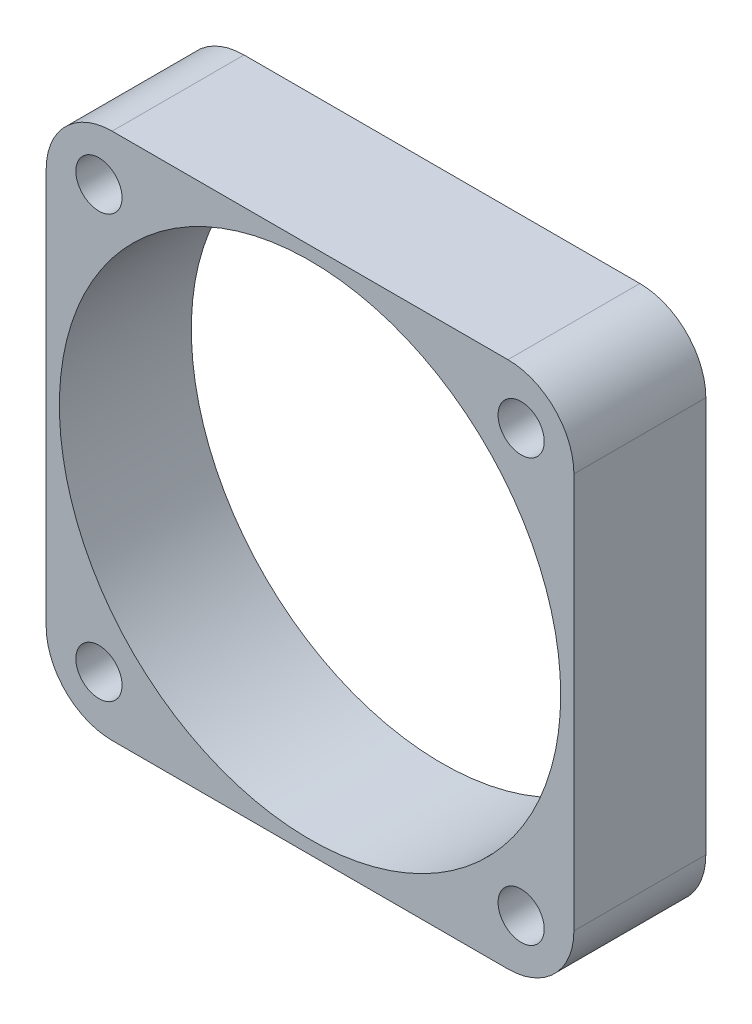
ISO-10303-21;
HEADER;
FILE_DESCRIPTION(('STEP AP214'),'2;1');
FILE_NAME('part.step','',(''),(''),'','','');
FILE_SCHEMA(('AUTOMOTIVE_DESIGN { 1 0 10303 214 1 1 1 1 }'));
ENDSEC;
DATA;
#1=APPLICATION_CONTEXT('core data for automotive mechanical design processes');
#2=APPLICATION_PROTOCOL_DEFINITION('international standard','automotive_design',2000,#1);
#3=PRODUCT_CONTEXT('',#1,'mechanical');
#4=PRODUCT('Part','Part','',(#3));
#5=PRODUCT_RELATED_PRODUCT_CATEGORY('part','',(#4));
#6=PRODUCT_DEFINITION_FORMATION('','',#4);
#7=PRODUCT_DEFINITION_CONTEXT('part definition',#1,'design');
#8=PRODUCT_DEFINITION('design','',#6,#7);
#9=PRODUCT_DEFINITION_SHAPE('','',#8);
#10=(LENGTH_UNIT() NAMED_UNIT(*) SI_UNIT(.MILLI.,.METRE.));
#11=(NAMED_UNIT(*) PLANE_ANGLE_UNIT() SI_UNIT($,.RADIAN.));
#12=(NAMED_UNIT(*) SI_UNIT($,.STERADIAN.) SOLID_ANGLE_UNIT());
#13=UNCERTAINTY_MEASURE_WITH_UNIT(LENGTH_MEASURE(1.E-05),#10,'distance_accuracy_value','');
#14=(GEOMETRIC_REPRESENTATION_CONTEXT(3) GLOBAL_UNCERTAINTY_ASSIGNED_CONTEXT((#13)) GLOBAL_UNIT_ASSIGNED_CONTEXT((#10,
#11,#12)) REPRESENTATION_CONTEXT('',''));
#15=CARTESIAN_POINT('',(0.,0.,0.));
#16=DIRECTION('',(0.,0.,1.));
#17=DIRECTION('',(1.,0.,0.));
#18=AXIS2_PLACEMENT_3D('',#15,#16,#17);
#19=CARTESIAN_POINT('',(0.,0.,10.));
#20=DIRECTION('',(1.,0.,0.));
#21=DIRECTION('',(0.,0.,-1.));
#22=AXIS2_PLACEMENT_3D('',#19,#20,#21);
#23=PLANE('',#22);
#24=DIRECTION('',(0.,-1.,0.));
#25=VECTOR('',#24,1.);
#26=CARTESIAN_POINT('',(0.,0.,0.));
#27=LINE('',#26,#25);
#28=CARTESIAN_POINT('',(0.,35.,0.));
#29=VERTEX_POINT('',#28);
#30=CARTESIAN_POINT('',(0.,5.,0.));
#31=VERTEX_POINT('',#30);
#32=EDGE_CURVE('E151',#29,#31,#27,.T.);
#33=ORIENTED_EDGE('',*,*,#32,.T.);
#34=DIRECTION('',(0.,0.,-1.));
#35=VECTOR('',#34,1.);
#36=CARTESIAN_POINT('',(0.,5.,10.));
#37=LINE('',#36,#35);
#38=CARTESIAN_POINT('',(0.,5.,10.));
#39=VERTEX_POINT('',#38);
#40=EDGE_CURVE('E129',#31,#39,#37,.F.);
#41=ORIENTED_EDGE('',*,*,#40,.T.);
#42=DIRECTION('',(0.,-1.,0.));
#43=VECTOR('',#42,1.);
#44=CARTESIAN_POINT('',(0.,0.,10.));
#45=LINE('',#44,#43);
#46=CARTESIAN_POINT('',(0.,35.,10.));
#47=VERTEX_POINT('',#46);
#48=EDGE_CURVE('E161',#47,#39,#45,.T.);
#49=ORIENTED_EDGE('',*,*,#48,.F.);
#50=DIRECTION('',(0.,0.,-1.));
#51=VECTOR('',#50,1.);
#52=CARTESIAN_POINT('',(0.,35.,10.));
#53=LINE('',#52,#51);
#54=EDGE_CURVE('E134',#47,#29,#53,.T.);
#55=ORIENTED_EDGE('',*,*,#54,.T.);
#56=EDGE_LOOP('',(#33,#41,#49,#55));
#57=FACE_BOUND('',#56,.T.);
#58=ADVANCED_FACE('F59',(#57),#23,.F.);
#59=CARTESIAN_POINT('',(0.,0.,10.));
#60=DIRECTION('',(0.,1.,0.));
#61=DIRECTION('',(0.,0.,1.));
#62=AXIS2_PLACEMENT_3D('',#59,#60,#61);
#63=PLANE('',#62);
#64=DIRECTION('',(1.,0.,0.));
#65=VECTOR('',#64,1.);
#66=CARTESIAN_POINT('',(0.,0.,10.));
#67=LINE('',#66,#65);
#68=CARTESIAN_POINT('',(5.,0.,10.));
#69=VERTEX_POINT('',#68);
#70=CARTESIAN_POINT('',(35.,0.,10.));
#71=VERTEX_POINT('',#70);
#72=EDGE_CURVE('E144',#69,#71,#67,.T.);
#73=ORIENTED_EDGE('',*,*,#72,.F.);
#74=DIRECTION('',(0.,0.,-1.));
#75=VECTOR('',#74,1.);
#76=CARTESIAN_POINT('',(5.,0.,10.));
#77=LINE('',#76,#75);
#78=CARTESIAN_POINT('',(5.,0.,0.));
#79=VERTEX_POINT('',#78);
#80=EDGE_CURVE('E128',#69,#79,#77,.T.);
#81=ORIENTED_EDGE('',*,*,#80,.T.);
#82=DIRECTION('',(1.,0.,0.));
#83=VECTOR('',#82,1.);
#84=CARTESIAN_POINT('',(0.,0.,0.));
#85=LINE('',#84,#83);
#86=CARTESIAN_POINT('',(35.,0.,0.));
#87=VERTEX_POINT('',#86);
#88=EDGE_CURVE('E141',#79,#87,#85,.T.);
#89=ORIENTED_EDGE('',*,*,#88,.T.);
#90=DIRECTION('',(0.,0.,-1.));
#91=VECTOR('',#90,1.);
#92=CARTESIAN_POINT('',(35.,0.,10.));
#93=LINE('',#92,#91);
#94=EDGE_CURVE('E146',#87,#71,#93,.F.);
#95=ORIENTED_EDGE('',*,*,#94,.T.);
#96=EDGE_LOOP('',(#73,#81,#89,#95));
#97=FACE_BOUND('',#96,.T.);
#98=ADVANCED_FACE('F140',(#97),#63,.F.);
#99=CARTESIAN_POINT('',(40.,0.,10.));
#100=DIRECTION('',(-1.,0.,0.));
#101=DIRECTION('',(0.,0.,1.));
#102=AXIS2_PLACEMENT_3D('',#99,#100,#101);
#103=PLANE('',#102);
#104=DIRECTION('',(0.,1.,0.));
#105=VECTOR('',#104,1.);
#106=CARTESIAN_POINT('',(40.,0.,10.));
#107=LINE('',#106,#105);
#108=CARTESIAN_POINT('',(40.,5.,10.));
#109=VERTEX_POINT('',#108);
#110=CARTESIAN_POINT('',(40.,35.,10.));
#111=VERTEX_POINT('',#110);
#112=EDGE_CURVE('E195',#109,#111,#107,.T.);
#113=ORIENTED_EDGE('',*,*,#112,.F.);
#114=DIRECTION('',(0.,0.,-1.));
#115=VECTOR('',#114,1.);
#116=CARTESIAN_POINT('',(40.,5.,10.));
#117=LINE('',#116,#115);
#118=CARTESIAN_POINT('',(40.,5.,0.));
#119=VERTEX_POINT('',#118);
#120=EDGE_CURVE('E180',#109,#119,#117,.T.);
#121=ORIENTED_EDGE('',*,*,#120,.T.);
#122=DIRECTION('',(0.,1.,0.));
#123=VECTOR('',#122,1.);
#124=CARTESIAN_POINT('',(40.,0.,0.));
#125=LINE('',#124,#123);
#126=CARTESIAN_POINT('',(40.,35.,0.));
#127=VERTEX_POINT('',#126);
#128=EDGE_CURVE('E150',#119,#127,#125,.T.);
#129=ORIENTED_EDGE('',*,*,#128,.T.);
#130=DIRECTION('',(0.,0.,-1.));
#131=VECTOR('',#130,1.);
#132=CARTESIAN_POINT('',(40.,35.,10.));
#133=LINE('',#132,#131);
#134=EDGE_CURVE('E178',#127,#111,#133,.F.);
#135=ORIENTED_EDGE('',*,*,#134,.T.);
#136=EDGE_LOOP('',(#113,#121,#129,#135));
#137=FACE_BOUND('',#136,.T.);
#138=ADVANCED_FACE('F212',(#137),#103,.F.);
#139=CARTESIAN_POINT('',(0.,40.,10.));
#140=DIRECTION('',(0.,-1.,0.));
#141=DIRECTION('',(0.,0.,-1.));
#142=AXIS2_PLACEMENT_3D('',#139,#140,#141);
#143=PLANE('',#142);
#144=DIRECTION('',(-1.,0.,0.));
#145=VECTOR('',#144,1.);
#146=CARTESIAN_POINT('',(0.,40.,0.));
#147=LINE('',#146,#145);
#148=CARTESIAN_POINT('',(35.,40.,0.));
#149=VERTEX_POINT('',#148);
#150=CARTESIAN_POINT('',(5.,40.,0.));
#151=VERTEX_POINT('',#150);
#152=EDGE_CURVE('E154',#149,#151,#147,.T.);
#153=ORIENTED_EDGE('',*,*,#152,.T.);
#154=DIRECTION('',(0.,0.,-1.));
#155=VECTOR('',#154,1.);
#156=CARTESIAN_POINT('',(5.,40.,10.));
#157=LINE('',#156,#155);
#158=CARTESIAN_POINT('',(5.,40.,10.));
#159=VERTEX_POINT('',#158);
#160=EDGE_CURVE('E12',#151,#159,#157,.F.);
#161=ORIENTED_EDGE('',*,*,#160,.T.);
#162=DIRECTION('',(-1.,0.,0.));
#163=VECTOR('',#162,1.);
#164=CARTESIAN_POINT('',(0.,40.,10.));
#165=LINE('',#164,#163);
#166=CARTESIAN_POINT('',(35.,40.,10.));
#167=VERTEX_POINT('',#166);
#168=EDGE_CURVE('E162',#167,#159,#165,.T.);
#169=ORIENTED_EDGE('',*,*,#168,.F.);
#170=DIRECTION('',(0.,0.,-1.));
#171=VECTOR('',#170,1.);
#172=CARTESIAN_POINT('',(35.,40.,10.));
#173=LINE('',#172,#171);
#174=EDGE_CURVE('E67',#167,#149,#173,.T.);
#175=ORIENTED_EDGE('',*,*,#174,.T.);
#176=EDGE_LOOP('',(#153,#161,#169,#175));
#177=FACE_BOUND('',#176,.T.);
#178=ADVANCED_FACE('F185',(#177),#143,.F.);
#179=CARTESIAN_POINT('',(0.,0.,10.));
#180=DIRECTION('',(0.,0.,-1.));
#181=DIRECTION('',(-1.,0.,0.));
#182=AXIS2_PLACEMENT_3D('',#179,#180,#181);
#183=PLANE('',#182);
#184=CARTESIAN_POINT('',(36.,36.,10.));
#185=DIRECTION('',(0.,0.,1.));
#186=DIRECTION('',(1.,0.,0.));
#187=AXIS2_PLACEMENT_3D('',#184,#185,#186);
#188=CIRCLE('',#187,1.75);
#189=CARTESIAN_POINT('',(37.75,36.,10.));
#190=VERTEX_POINT('',#189);
#191=EDGE_CURVE('E361',#190,#190,#188,.T.);
#192=ORIENTED_EDGE('',*,*,#191,.F.);
#193=EDGE_LOOP('',(#192));
#194=FACE_BOUND('',#193,.T.);
#195=CARTESIAN_POINT('',(36.,4.00000000000001,10.));
#196=DIRECTION('',(0.,0.,1.));
#197=DIRECTION('',(1.,0.,0.));
#198=AXIS2_PLACEMENT_3D('',#195,#196,#197);
#199=CIRCLE('',#198,1.75);
#200=CARTESIAN_POINT('',(37.75,4.00000000000001,10.));
#201=VERTEX_POINT('',#200);
#202=EDGE_CURVE('E355',#201,#201,#199,.T.);
#203=ORIENTED_EDGE('',*,*,#202,.F.);
#204=EDGE_LOOP('',(#203));
#205=FACE_BOUND('',#204,.T.);
#206=CARTESIAN_POINT('',(4.,4.00000000000001,10.));
#207=DIRECTION('',(0.,0.,1.));
#208=DIRECTION('',(1.,0.,0.));
#209=AXIS2_PLACEMENT_3D('',#206,#207,#208);
#210=CIRCLE('',#209,1.75);
#211=CARTESIAN_POINT('',(5.75,4.00000000000001,10.));
#212=VERTEX_POINT('',#211);
#213=EDGE_CURVE('E349',#212,#212,#210,.T.);
#214=ORIENTED_EDGE('',*,*,#213,.F.);
#215=EDGE_LOOP('',(#214));
#216=FACE_BOUND('',#215,.T.);
#217=CARTESIAN_POINT('',(4.,36.,10.));
#218=DIRECTION('',(0.,0.,1.));
#219=DIRECTION('',(1.,0.,0.));
#220=AXIS2_PLACEMENT_3D('',#217,#218,#219);
#221=CIRCLE('',#220,1.75);
#222=CARTESIAN_POINT('',(5.75,36.,10.));
#223=VERTEX_POINT('',#222);
#224=EDGE_CURVE('E341',#223,#223,#221,.T.);
#225=ORIENTED_EDGE('',*,*,#224,.F.);
#226=EDGE_LOOP('',(#225));
#227=FACE_BOUND('',#226,.T.);
#228=CARTESIAN_POINT('',(20.,20.,10.));
#229=DIRECTION('',(0.,0.,1.));
#230=DIRECTION('',(1.,0.,0.));
#231=AXIS2_PLACEMENT_3D('',#228,#229,#230);
#232=CIRCLE('',#231,19.);
#233=CARTESIAN_POINT('',(39.,20.,10.));
#234=VERTEX_POINT('',#233);
#235=EDGE_CURVE('E198',#234,#234,#232,.T.);
#236=ORIENTED_EDGE('',*,*,#235,.F.);
#237=EDGE_LOOP('',(#236));
#238=FACE_BOUND('',#237,.T.);
#239=ORIENTED_EDGE('',*,*,#48,.T.);
#240=CARTESIAN_POINT('',(5.,5.,10.));
#241=DIRECTION('',(0.,0.,-1.));
#242=DIRECTION('',(-1.,0.,0.));
#243=AXIS2_PLACEMENT_3D('',#240,#241,#242);
#244=CIRCLE('',#243,5.);
#245=EDGE_CURVE('E176',#39,#69,#244,.F.);
#246=ORIENTED_EDGE('',*,*,#245,.T.);
#247=ORIENTED_EDGE('',*,*,#72,.T.);
#248=CARTESIAN_POINT('',(35.,5.,10.));
#249=DIRECTION('',(0.,0.,-1.));
#250=DIRECTION('',(-1.,0.,0.));
#251=AXIS2_PLACEMENT_3D('',#248,#249,#250);
#252=CIRCLE('',#251,5.);
#253=EDGE_CURVE('E174',#71,#109,#252,.F.);
#254=ORIENTED_EDGE('',*,*,#253,.T.);
#255=ORIENTED_EDGE('',*,*,#112,.T.);
#256=CARTESIAN_POINT('',(35.,35.,10.));
#257=DIRECTION('',(0.,0.,-1.));
#258=DIRECTION('',(-1.,0.,0.));
#259=AXIS2_PLACEMENT_3D('',#256,#257,#258);
#260=CIRCLE('',#259,5.);
#261=EDGE_CURVE('E79',#111,#167,#260,.F.);
#262=ORIENTED_EDGE('',*,*,#261,.T.);
#263=ORIENTED_EDGE('',*,*,#168,.T.);
#264=CARTESIAN_POINT('',(5.,35.,10.));
#265=DIRECTION('',(0.,0.,-1.));
#266=DIRECTION('',(-1.,0.,0.));
#267=AXIS2_PLACEMENT_3D('',#264,#265,#266);
#268=CIRCLE('',#267,5.);
#269=EDGE_CURVE('E172',#159,#47,#268,.F.);
#270=ORIENTED_EDGE('',*,*,#269,.T.);
#271=EDGE_LOOP('',(#239,#246,#247,#254,#255,#262,#263,#270));
#272=FACE_BOUND('',#271,.T.);
#273=ADVANCED_FACE('F201',(#194,#205,#216,#227,#238,#272),#183,.F.);
#274=CARTESIAN_POINT('',(0.,0.,0.));
#275=DIRECTION('',(0.,0.,-1.));
#276=DIRECTION('',(-1.,0.,0.));
#277=AXIS2_PLACEMENT_3D('',#274,#275,#276);
#278=PLANE('',#277);
#279=CARTESIAN_POINT('',(36.,36.,0.));
#280=DIRECTION('',(0.,0.,1.));
#281=DIRECTION('',(1.,0.,0.));
#282=AXIS2_PLACEMENT_3D('',#279,#280,#281);
#283=CIRCLE('',#282,1.75);
#284=CARTESIAN_POINT('',(37.75,36.,0.));
#285=VERTEX_POINT('',#284);
#286=EDGE_CURVE('E358',#285,#285,#283,.T.);
#287=ORIENTED_EDGE('',*,*,#286,.T.);
#288=EDGE_LOOP('',(#287));
#289=FACE_BOUND('',#288,.T.);
#290=CARTESIAN_POINT('',(36.,4.00000000000001,0.));
#291=DIRECTION('',(0.,0.,1.));
#292=DIRECTION('',(1.,0.,0.));
#293=AXIS2_PLACEMENT_3D('',#290,#291,#292);
#294=CIRCLE('',#293,1.75);
#295=CARTESIAN_POINT('',(37.75,4.00000000000001,0.));
#296=VERTEX_POINT('',#295);
#297=EDGE_CURVE('E352',#296,#296,#294,.T.);
#298=ORIENTED_EDGE('',*,*,#297,.T.);
#299=EDGE_LOOP('',(#298));
#300=FACE_BOUND('',#299,.T.);
#301=CARTESIAN_POINT('',(4.,4.00000000000001,0.));
#302=DIRECTION('',(0.,0.,1.));
#303=DIRECTION('',(1.,0.,0.));
#304=AXIS2_PLACEMENT_3D('',#301,#302,#303);
#305=CIRCLE('',#304,1.75);
#306=CARTESIAN_POINT('',(5.75,4.00000000000001,0.));
#307=VERTEX_POINT('',#306);
#308=EDGE_CURVE('E346',#307,#307,#305,.T.);
#309=ORIENTED_EDGE('',*,*,#308,.T.);
#310=EDGE_LOOP('',(#309));
#311=FACE_BOUND('',#310,.T.);
#312=CARTESIAN_POINT('',(4.,36.,0.));
#313=DIRECTION('',(0.,0.,1.));
#314=DIRECTION('',(1.,0.,0.));
#315=AXIS2_PLACEMENT_3D('',#312,#313,#314);
#316=CIRCLE('',#315,1.75);
#317=CARTESIAN_POINT('',(5.75,36.,0.));
#318=VERTEX_POINT('',#317);
#319=EDGE_CURVE('E339',#318,#318,#316,.T.);
#320=ORIENTED_EDGE('',*,*,#319,.T.);
#321=EDGE_LOOP('',(#320));
#322=FACE_BOUND('',#321,.T.);
#323=CARTESIAN_POINT('',(20.,20.,0.));
#324=DIRECTION('',(0.,0.,1.));
#325=DIRECTION('',(1.,0.,0.));
#326=AXIS2_PLACEMENT_3D('',#323,#324,#325);
#327=CIRCLE('',#326,19.);
#328=CARTESIAN_POINT('',(39.,20.,0.));
#329=VERTEX_POINT('',#328);
#330=EDGE_CURVE('E156',#329,#329,#327,.T.);
#331=ORIENTED_EDGE('',*,*,#330,.T.);
#332=EDGE_LOOP('',(#331));
#333=FACE_BOUND('',#332,.T.);
#334=ORIENTED_EDGE('',*,*,#88,.F.);
#335=CARTESIAN_POINT('',(5.,5.,0.));
#336=DIRECTION('',(0.,0.,-1.));
#337=DIRECTION('',(-1.,0.,0.));
#338=AXIS2_PLACEMENT_3D('',#335,#336,#337);
#339=CIRCLE('',#338,5.);
#340=EDGE_CURVE('E124',#79,#31,#339,.T.);
#341=ORIENTED_EDGE('',*,*,#340,.T.);
#342=ORIENTED_EDGE('',*,*,#32,.F.);
#343=CARTESIAN_POINT('',(5.,35.,0.));
#344=DIRECTION('',(0.,0.,-1.));
#345=DIRECTION('',(-1.,0.,0.));
#346=AXIS2_PLACEMENT_3D('',#343,#344,#345);
#347=CIRCLE('',#346,5.);
#348=EDGE_CURVE('E165',#29,#151,#347,.T.);
#349=ORIENTED_EDGE('',*,*,#348,.T.);
#350=ORIENTED_EDGE('',*,*,#152,.F.);
#351=CARTESIAN_POINT('',(35.,35.,0.));
#352=DIRECTION('',(0.,0.,-1.));
#353=DIRECTION('',(-1.,0.,0.));
#354=AXIS2_PLACEMENT_3D('',#351,#352,#353);
#355=CIRCLE('',#354,5.);
#356=EDGE_CURVE('E145',#149,#127,#355,.T.);
#357=ORIENTED_EDGE('',*,*,#356,.T.);
#358=ORIENTED_EDGE('',*,*,#128,.F.);
#359=CARTESIAN_POINT('',(35.,5.,0.));
#360=DIRECTION('',(0.,0.,-1.));
#361=DIRECTION('',(-1.,0.,0.));
#362=AXIS2_PLACEMENT_3D('',#359,#360,#361);
#363=CIRCLE('',#362,5.);
#364=EDGE_CURVE('E135',#119,#87,#363,.T.);
#365=ORIENTED_EDGE('',*,*,#364,.T.);
#366=EDGE_LOOP('',(#334,#341,#342,#349,#350,#357,#358,#365));
#367=FACE_BOUND('',#366,.T.);
#368=ADVANCED_FACE('F148',(#289,#300,#311,#322,#333,#367),#278,.T.);
#369=CARTESIAN_POINT('',(20.,20.,0.));
#370=DIRECTION('',(0.,0.,1.));
#371=DIRECTION('',(1.,0.,0.));
#372=AXIS2_PLACEMENT_3D('',#369,#370,#371);
#373=CYLINDRICAL_SURFACE('',#372,19.);
#374=ORIENTED_EDGE('',*,*,#330,.F.);
#375=EDGE_LOOP('',(#374));
#376=FACE_BOUND('',#375,.T.);
#377=ORIENTED_EDGE('',*,*,#235,.T.);
#378=EDGE_LOOP('',(#377));
#379=FACE_BOUND('',#378,.T.);
#380=ADVANCED_FACE('F209',(#376,#379),#373,.F.);
#381=CARTESIAN_POINT('',(4.,36.,0.));
#382=DIRECTION('',(0.,0.,1.));
#383=DIRECTION('',(1.,0.,0.));
#384=AXIS2_PLACEMENT_3D('',#381,#382,#383);
#385=CYLINDRICAL_SURFACE('',#384,1.75);
#386=ORIENTED_EDGE('',*,*,#319,.F.);
#387=EDGE_LOOP('',(#386));
#388=FACE_BOUND('',#387,.T.);
#389=ORIENTED_EDGE('',*,*,#224,.T.);
#390=EDGE_LOOP('',(#389));
#391=FACE_BOUND('',#390,.T.);
#392=ADVANCED_FACE('F308',(#388,#391),#385,.F.);
#393=CARTESIAN_POINT('',(4.,4.00000000000001,0.));
#394=DIRECTION('',(0.,0.,1.));
#395=DIRECTION('',(1.,0.,0.));
#396=AXIS2_PLACEMENT_3D('',#393,#394,#395);
#397=CYLINDRICAL_SURFACE('',#396,1.75);
#398=ORIENTED_EDGE('',*,*,#308,.F.);
#399=EDGE_LOOP('',(#398));
#400=FACE_BOUND('',#399,.T.);
#401=ORIENTED_EDGE('',*,*,#213,.T.);
#402=EDGE_LOOP('',(#401));
#403=FACE_BOUND('',#402,.T.);
#404=ADVANCED_FACE('F300',(#400,#403),#397,.F.);
#405=CARTESIAN_POINT('',(36.,4.00000000000001,0.));
#406=DIRECTION('',(0.,0.,1.));
#407=DIRECTION('',(1.,0.,0.));
#408=AXIS2_PLACEMENT_3D('',#405,#406,#407);
#409=CYLINDRICAL_SURFACE('',#408,1.75);
#410=ORIENTED_EDGE('',*,*,#297,.F.);
#411=EDGE_LOOP('',(#410));
#412=FACE_BOUND('',#411,.T.);
#413=ORIENTED_EDGE('',*,*,#202,.T.);
#414=EDGE_LOOP('',(#413));
#415=FACE_BOUND('',#414,.T.);
#416=ADVANCED_FACE('F292',(#412,#415),#409,.F.);
#417=CARTESIAN_POINT('',(36.,36.,0.));
#418=DIRECTION('',(0.,0.,1.));
#419=DIRECTION('',(1.,0.,0.));
#420=AXIS2_PLACEMENT_3D('',#417,#418,#419);
#421=CYLINDRICAL_SURFACE('',#420,1.75);
#422=ORIENTED_EDGE('',*,*,#286,.F.);
#423=EDGE_LOOP('',(#422));
#424=FACE_BOUND('',#423,.T.);
#425=ORIENTED_EDGE('',*,*,#191,.T.);
#426=EDGE_LOOP('',(#425));
#427=FACE_BOUND('',#426,.T.);
#428=ADVANCED_FACE('F228',(#424,#427),#421,.F.);
#429=CARTESIAN_POINT('',(5.,5.,10.));
#430=DIRECTION('',(0.,0.,-1.));
#431=DIRECTION('',(-1.,0.,0.));
#432=AXIS2_PLACEMENT_3D('',#429,#430,#431);
#433=CYLINDRICAL_SURFACE('',#432,5.);
#434=ORIENTED_EDGE('',*,*,#245,.F.);
#435=ORIENTED_EDGE('',*,*,#40,.F.);
#436=ORIENTED_EDGE('',*,*,#340,.F.);
#437=ORIENTED_EDGE('',*,*,#80,.F.);
#438=EDGE_LOOP('',(#434,#435,#436,#437));
#439=FACE_BOUND('',#438,.T.);
#440=ADVANCED_FACE('F127',(#439),#433,.T.);
#441=CARTESIAN_POINT('',(35.,5.,10.));
#442=DIRECTION('',(0.,0.,-1.));
#443=DIRECTION('',(-1.,0.,0.));
#444=AXIS2_PLACEMENT_3D('',#441,#442,#443);
#445=CYLINDRICAL_SURFACE('',#444,5.);
#446=ORIENTED_EDGE('',*,*,#253,.F.);
#447=ORIENTED_EDGE('',*,*,#94,.F.);
#448=ORIENTED_EDGE('',*,*,#364,.F.);
#449=ORIENTED_EDGE('',*,*,#120,.F.);
#450=EDGE_LOOP('',(#446,#447,#448,#449));
#451=FACE_BOUND('',#450,.T.);
#452=ADVANCED_FACE('F227',(#451),#445,.T.);
#453=CARTESIAN_POINT('',(5.,35.,10.));
#454=DIRECTION('',(0.,0.,-1.));
#455=DIRECTION('',(-1.,0.,0.));
#456=AXIS2_PLACEMENT_3D('',#453,#454,#455);
#457=CYLINDRICAL_SURFACE('',#456,5.);
#458=ORIENTED_EDGE('',*,*,#269,.F.);
#459=ORIENTED_EDGE('',*,*,#160,.F.);
#460=ORIENTED_EDGE('',*,*,#348,.F.);
#461=ORIENTED_EDGE('',*,*,#54,.F.);
#462=EDGE_LOOP('',(#458,#459,#460,#461));
#463=FACE_BOUND('',#462,.T.);
#464=ADVANCED_FACE('F190',(#463),#457,.T.);
#465=CARTESIAN_POINT('',(35.,35.,10.));
#466=DIRECTION('',(0.,0.,-1.));
#467=DIRECTION('',(-1.,0.,0.));
#468=AXIS2_PLACEMENT_3D('',#465,#466,#467);
#469=CYLINDRICAL_SURFACE('',#468,5.);
#470=ORIENTED_EDGE('',*,*,#261,.F.);
#471=ORIENTED_EDGE('',*,*,#134,.F.);
#472=ORIENTED_EDGE('',*,*,#356,.F.);
#473=ORIENTED_EDGE('',*,*,#174,.F.);
#474=EDGE_LOOP('',(#470,#471,#472,#473));
#475=FACE_BOUND('',#474,.T.);
#476=ADVANCED_FACE('F61',(#475),#469,.T.);
#477=CLOSED_SHELL('',(#58,#98,#138,#178,#273,#368,#380,#392,#404,#416,#428,#440,#452,#464,#476));
#478=MANIFOLD_SOLID_BREP('B2',#477);
#479=ADVANCED_BREP_SHAPE_REPRESENTATION('',(#18,#478),#14);
#480=SHAPE_DEFINITION_REPRESENTATION(#9,#479);
ENDSEC;
END-ISO-10303-21;
